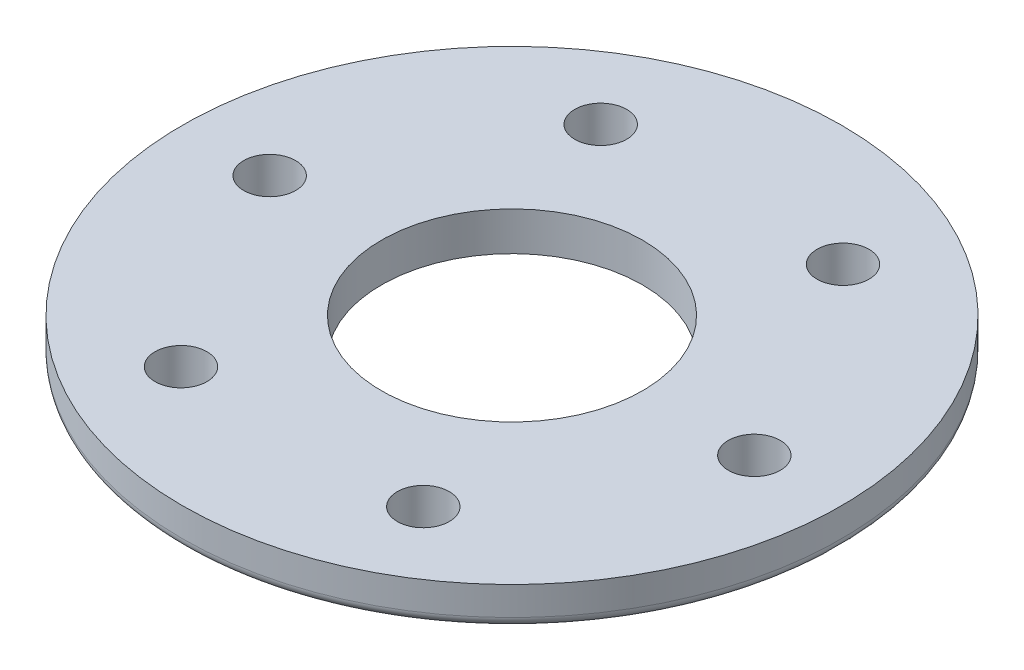
ISO-10303-21;
HEADER;
FILE_DESCRIPTION(('STEP AP214'),'2;1');
FILE_NAME('part.step','',(''),(''),'','','');
FILE_SCHEMA(('AUTOMOTIVE_DESIGN { 1 0 10303 214 1 1 1 1 }'));
ENDSEC;
DATA;
#1=APPLICATION_CONTEXT('core data for automotive mechanical design processes');
#2=APPLICATION_PROTOCOL_DEFINITION('international standard','automotive_design',2000,#1);
#3=PRODUCT_CONTEXT('',#1,'mechanical');
#4=PRODUCT('Part','Part','',(#3));
#5=PRODUCT_RELATED_PRODUCT_CATEGORY('part','',(#4));
#6=PRODUCT_DEFINITION_FORMATION('','',#4);
#7=PRODUCT_DEFINITION_CONTEXT('part definition',#1,'design');
#8=PRODUCT_DEFINITION('design','',#6,#7);
#9=PRODUCT_DEFINITION_SHAPE('','',#8);
#10=(LENGTH_UNIT() NAMED_UNIT(*) SI_UNIT(.MILLI.,.METRE.));
#11=(NAMED_UNIT(*) PLANE_ANGLE_UNIT() SI_UNIT($,.RADIAN.));
#12=(NAMED_UNIT(*) SI_UNIT($,.STERADIAN.) SOLID_ANGLE_UNIT());
#13=UNCERTAINTY_MEASURE_WITH_UNIT(LENGTH_MEASURE(1.E-05),#10,'distance_accuracy_value','');
#14=(GEOMETRIC_REPRESENTATION_CONTEXT(3) GLOBAL_UNCERTAINTY_ASSIGNED_CONTEXT((#13)) GLOBAL_UNIT_ASSIGNED_CONTEXT((#10,
#11,#12)) REPRESENTATION_CONTEXT('',''));
#15=CARTESIAN_POINT('',(0.,0.,0.));
#16=DIRECTION('',(0.,0.,1.));
#17=DIRECTION('',(1.,0.,0.));
#18=AXIS2_PLACEMENT_3D('',#15,#16,#17);
#19=CARTESIAN_POINT('',(0.,0.,0.));
#20=DIRECTION('',(0.,1.,0.));
#21=DIRECTION('',(0.,0.,1.));
#22=AXIS2_PLACEMENT_3D('',#19,#20,#21);
#23=CYLINDRICAL_SURFACE('',#22,32.385);
#24=CARTESIAN_POINT('',(0.,1.00000000000006,0.));
#25=DIRECTION('',(0.,-1.,0.));
#26=DIRECTION('',(0.,0.,-1.));
#27=AXIS2_PLACEMENT_3D('',#24,#25,#26);
#28=CIRCLE('',#27,32.385);
#29=CARTESIAN_POINT('',(0.,1.00000000000006,-32.385));
#30=VERTEX_POINT('',#29);
#31=EDGE_CURVE('E38',#30,#30,#28,.F.);
#32=ORIENTED_EDGE('',*,*,#31,.T.);
#33=EDGE_LOOP('',(#32));
#34=FACE_BOUND('',#33,.T.);
#35=CARTESIAN_POINT('',(0.,3.81,0.));
#36=DIRECTION('',(0.,1.,0.));
#37=DIRECTION('',(0.,0.,1.));
#38=AXIS2_PLACEMENT_3D('',#35,#36,#37);
#39=CIRCLE('',#38,32.385);
#40=CARTESIAN_POINT('',(0.,3.81,32.385));
#41=VERTEX_POINT('',#40);
#42=EDGE_CURVE('E42',#41,#41,#39,.T.);
#43=ORIENTED_EDGE('',*,*,#42,.F.);
#44=EDGE_LOOP('',(#43));
#45=FACE_BOUND('',#44,.T.);
#46=ADVANCED_FACE('F31',(#34,#45),#23,.T.);
#47=CARTESIAN_POINT('',(32.385,0.,0.));
#48=DIRECTION('',(0.,-1.,0.));
#49=DIRECTION('',(0.,0.,-1.));
#50=AXIS2_PLACEMENT_3D('',#47,#48,#49);
#51=PLANE('',#50);
#52=CARTESIAN_POINT('',(0.,0.,0.));
#53=DIRECTION('',(0.,-1.,0.));
#54=DIRECTION('',(0.,0.,-1.));
#55=AXIS2_PLACEMENT_3D('',#52,#53,#54);
#56=CIRCLE('',#55,31.3849999999999);
#57=CARTESIAN_POINT('',(0.,0.,-31.3849999999999));
#58=VERTEX_POINT('',#57);
#59=EDGE_CURVE('E10',#58,#58,#56,.T.);
#60=ORIENTED_EDGE('',*,*,#59,.T.);
#61=EDGE_LOOP('',(#60));
#62=FACE_BOUND('',#61,.T.);
#63=CARTESIAN_POINT('',(0.,0.,0.));
#64=DIRECTION('',(0.,-1.,0.));
#65=DIRECTION('',(0.,0.,-1.));
#66=AXIS2_PLACEMENT_3D('',#63,#64,#65);
#67=CIRCLE('',#66,12.827);
#68=CARTESIAN_POINT('',(0.,0.,-12.827));
#69=VERTEX_POINT('',#68);
#70=EDGE_CURVE('E87',#69,#69,#67,.T.);
#71=ORIENTED_EDGE('',*,*,#70,.F.);
#72=EDGE_LOOP('',(#71));
#73=FACE_BOUND('',#72,.T.);
#74=CARTESIAN_POINT('',(-11.90625,0.,-20.6222299276167));
#75=DIRECTION('',(0.,-1.,0.));
#76=DIRECTION('',(0.,0.,-1.));
#77=AXIS2_PLACEMENT_3D('',#74,#75,#76);
#78=CIRCLE('',#77,2.55269999999999);
#79=CARTESIAN_POINT('',(-11.90625,0.,-23.1749299276166));
#80=VERTEX_POINT('',#79);
#81=EDGE_CURVE('E81',#80,#80,#78,.T.);
#82=ORIENTED_EDGE('',*,*,#81,.F.);
#83=EDGE_LOOP('',(#82));
#84=FACE_BOUND('',#83,.T.);
#85=CARTESIAN_POINT('',(11.90625,0.,-20.6222299276167));
#86=DIRECTION('',(0.,-1.,0.));
#87=DIRECTION('',(0.,0.,-1.));
#88=AXIS2_PLACEMENT_3D('',#85,#86,#87);
#89=CIRCLE('',#88,2.55269999999999);
#90=CARTESIAN_POINT('',(11.90625,0.,-23.1749299276166));
#91=VERTEX_POINT('',#90);
#92=EDGE_CURVE('E75',#91,#91,#89,.T.);
#93=ORIENTED_EDGE('',*,*,#92,.F.);
#94=EDGE_LOOP('',(#93));
#95=FACE_BOUND('',#94,.T.);
#96=CARTESIAN_POINT('',(23.8125,0.,0.));
#97=DIRECTION('',(0.,-1.,0.));
#98=DIRECTION('',(0.,0.,-1.));
#99=AXIS2_PLACEMENT_3D('',#96,#97,#98);
#100=CIRCLE('',#99,2.55269999999999);
#101=CARTESIAN_POINT('',(23.8125,0.,-2.55269999999999));
#102=VERTEX_POINT('',#101);
#103=EDGE_CURVE('E69',#102,#102,#100,.T.);
#104=ORIENTED_EDGE('',*,*,#103,.F.);
#105=EDGE_LOOP('',(#104));
#106=FACE_BOUND('',#105,.T.);
#107=CARTESIAN_POINT('',(11.90625,0.,20.6222299276167));
#108=DIRECTION('',(0.,-1.,0.));
#109=DIRECTION('',(0.,0.,-1.));
#110=AXIS2_PLACEMENT_3D('',#107,#108,#109);
#111=CIRCLE('',#110,2.55269999999999);
#112=CARTESIAN_POINT('',(11.90625,0.,18.0695299276167));
#113=VERTEX_POINT('',#112);
#114=EDGE_CURVE('E63',#113,#113,#111,.T.);
#115=ORIENTED_EDGE('',*,*,#114,.F.);
#116=EDGE_LOOP('',(#115));
#117=FACE_BOUND('',#116,.T.);
#118=CARTESIAN_POINT('',(-11.90625,0.,20.6222299276167));
#119=DIRECTION('',(0.,-1.,0.));
#120=DIRECTION('',(0.,0.,-1.));
#121=AXIS2_PLACEMENT_3D('',#118,#119,#120);
#122=CIRCLE('',#121,2.55269999999999);
#123=CARTESIAN_POINT('',(-11.90625,0.,18.0695299276167));
#124=VERTEX_POINT('',#123);
#125=EDGE_CURVE('E57',#124,#124,#122,.T.);
#126=ORIENTED_EDGE('',*,*,#125,.F.);
#127=EDGE_LOOP('',(#126));
#128=FACE_BOUND('',#127,.T.);
#129=CARTESIAN_POINT('',(-23.8125,0.,0.));
#130=DIRECTION('',(0.,-1.,0.));
#131=DIRECTION('',(0.,0.,-1.));
#132=AXIS2_PLACEMENT_3D('',#129,#130,#131);
#133=CIRCLE('',#132,2.55269999999999);
#134=CARTESIAN_POINT('',(-23.8125,0.,-2.55269999999999));
#135=VERTEX_POINT('',#134);
#136=EDGE_CURVE('E51',#135,#135,#133,.T.);
#137=ORIENTED_EDGE('',*,*,#136,.F.);
#138=EDGE_LOOP('',(#137));
#139=FACE_BOUND('',#138,.T.);
#140=ADVANCED_FACE('F93',(#62,#73,#84,#95,#106,#117,#128,#139),#51,.T.);
#141=CARTESIAN_POINT('',(0.,3.81,0.));
#142=DIRECTION('',(0.,1.,0.));
#143=DIRECTION('',(0.,0.,1.));
#144=AXIS2_PLACEMENT_3D('',#141,#142,#143);
#145=PLANE('',#144);
#146=CARTESIAN_POINT('',(0.,3.80999999999999,0.));
#147=DIRECTION('',(0.,-1.,0.));
#148=DIRECTION('',(0.,0.,-1.));
#149=AXIS2_PLACEMENT_3D('',#146,#147,#148);
#150=CIRCLE('',#149,12.827);
#151=CARTESIAN_POINT('',(0.,3.80999999999999,-12.827));
#152=VERTEX_POINT('',#151);
#153=EDGE_CURVE('E84',#152,#152,#150,.T.);
#154=ORIENTED_EDGE('',*,*,#153,.T.);
#155=EDGE_LOOP('',(#154));
#156=FACE_BOUND('',#155,.T.);
#157=CARTESIAN_POINT('',(-11.90625,3.80999999999999,-20.6222299276167));
#158=DIRECTION('',(0.,-1.,0.));
#159=DIRECTION('',(0.,0.,-1.));
#160=AXIS2_PLACEMENT_3D('',#157,#158,#159);
#161=CIRCLE('',#160,2.55269999999999);
#162=CARTESIAN_POINT('',(-11.90625,3.80999999999999,-23.1749299276166));
#163=VERTEX_POINT('',#162);
#164=EDGE_CURVE('E78',#163,#163,#161,.T.);
#165=ORIENTED_EDGE('',*,*,#164,.T.);
#166=EDGE_LOOP('',(#165));
#167=FACE_BOUND('',#166,.T.);
#168=CARTESIAN_POINT('',(11.90625,3.80999999999999,-20.6222299276167));
#169=DIRECTION('',(0.,-1.,0.));
#170=DIRECTION('',(0.,0.,-1.));
#171=AXIS2_PLACEMENT_3D('',#168,#169,#170);
#172=CIRCLE('',#171,2.55269999999999);
#173=CARTESIAN_POINT('',(11.90625,3.80999999999999,-23.1749299276166));
#174=VERTEX_POINT('',#173);
#175=EDGE_CURVE('E72',#174,#174,#172,.T.);
#176=ORIENTED_EDGE('',*,*,#175,.T.);
#177=EDGE_LOOP('',(#176));
#178=FACE_BOUND('',#177,.T.);
#179=CARTESIAN_POINT('',(23.8125,3.80999999999999,0.));
#180=DIRECTION('',(0.,-1.,0.));
#181=DIRECTION('',(0.,0.,-1.));
#182=AXIS2_PLACEMENT_3D('',#179,#180,#181);
#183=CIRCLE('',#182,2.55269999999999);
#184=CARTESIAN_POINT('',(23.8125,3.80999999999999,-2.55269999999999));
#185=VERTEX_POINT('',#184);
#186=EDGE_CURVE('E66',#185,#185,#183,.T.);
#187=ORIENTED_EDGE('',*,*,#186,.T.);
#188=EDGE_LOOP('',(#187));
#189=FACE_BOUND('',#188,.T.);
#190=CARTESIAN_POINT('',(11.90625,3.80999999999999,20.6222299276167));
#191=DIRECTION('',(0.,-1.,0.));
#192=DIRECTION('',(0.,0.,-1.));
#193=AXIS2_PLACEMENT_3D('',#190,#191,#192);
#194=CIRCLE('',#193,2.55269999999999);
#195=CARTESIAN_POINT('',(11.90625,3.80999999999999,18.0695299276167));
#196=VERTEX_POINT('',#195);
#197=EDGE_CURVE('E60',#196,#196,#194,.T.);
#198=ORIENTED_EDGE('',*,*,#197,.T.);
#199=EDGE_LOOP('',(#198));
#200=FACE_BOUND('',#199,.T.);
#201=CARTESIAN_POINT('',(-11.90625,3.80999999999999,20.6222299276167));
#202=DIRECTION('',(0.,-1.,0.));
#203=DIRECTION('',(0.,0.,-1.));
#204=AXIS2_PLACEMENT_3D('',#201,#202,#203);
#205=CIRCLE('',#204,2.55269999999999);
#206=CARTESIAN_POINT('',(-11.90625,3.80999999999999,18.0695299276167));
#207=VERTEX_POINT('',#206);
#208=EDGE_CURVE('E54',#207,#207,#205,.T.);
#209=ORIENTED_EDGE('',*,*,#208,.T.);
#210=EDGE_LOOP('',(#209));
#211=FACE_BOUND('',#210,.T.);
#212=CARTESIAN_POINT('',(-23.8125,3.80999999999999,0.));
#213=DIRECTION('',(0.,-1.,0.));
#214=DIRECTION('',(0.,0.,-1.));
#215=AXIS2_PLACEMENT_3D('',#212,#213,#214);
#216=CIRCLE('',#215,2.55269999999999);
#217=CARTESIAN_POINT('',(-23.8125,3.80999999999999,-2.55269999999999));
#218=VERTEX_POINT('',#217);
#219=EDGE_CURVE('E46',#218,#218,#216,.T.);
#220=ORIENTED_EDGE('',*,*,#219,.T.);
#221=EDGE_LOOP('',(#220));
#222=FACE_BOUND('',#221,.T.);
#223=ORIENTED_EDGE('',*,*,#42,.T.);
#224=EDGE_LOOP('',(#223));
#225=FACE_BOUND('',#224,.T.);
#226=ADVANCED_FACE('F96',(#156,#167,#178,#189,#200,#211,#222,#225),#145,.T.);
#227=CARTESIAN_POINT('',(-23.8125,0.,0.));
#228=DIRECTION('',(0.,-1.,0.));
#229=DIRECTION('',(0.,0.,-1.));
#230=AXIS2_PLACEMENT_3D('',#227,#228,#229);
#231=CYLINDRICAL_SURFACE('',#230,2.55269999999999);
#232=ORIENTED_EDGE('',*,*,#219,.F.);
#233=EDGE_LOOP('',(#232));
#234=FACE_BOUND('',#233,.T.);
#235=ORIENTED_EDGE('',*,*,#136,.T.);
#236=EDGE_LOOP('',(#235));
#237=FACE_BOUND('',#236,.T.);
#238=ADVANCED_FACE('F110',(#234,#237),#231,.F.);
#239=CARTESIAN_POINT('',(-11.90625,0.,20.6222299276167));
#240=DIRECTION('',(0.,-1.,0.));
#241=DIRECTION('',(0.,0.,-1.));
#242=AXIS2_PLACEMENT_3D('',#239,#240,#241);
#243=CYLINDRICAL_SURFACE('',#242,2.55269999999999);
#244=ORIENTED_EDGE('',*,*,#208,.F.);
#245=EDGE_LOOP('',(#244));
#246=FACE_BOUND('',#245,.T.);
#247=ORIENTED_EDGE('',*,*,#125,.T.);
#248=EDGE_LOOP('',(#247));
#249=FACE_BOUND('',#248,.T.);
#250=ADVANCED_FACE('F112',(#246,#249),#243,.F.);
#251=CARTESIAN_POINT('',(11.90625,0.,20.6222299276167));
#252=DIRECTION('',(0.,-1.,0.));
#253=DIRECTION('',(0.,0.,-1.));
#254=AXIS2_PLACEMENT_3D('',#251,#252,#253);
#255=CYLINDRICAL_SURFACE('',#254,2.55269999999999);
#256=ORIENTED_EDGE('',*,*,#197,.F.);
#257=EDGE_LOOP('',(#256));
#258=FACE_BOUND('',#257,.T.);
#259=ORIENTED_EDGE('',*,*,#114,.T.);
#260=EDGE_LOOP('',(#259));
#261=FACE_BOUND('',#260,.T.);
#262=ADVANCED_FACE('F119',(#258,#261),#255,.F.);
#263=CARTESIAN_POINT('',(23.8125,0.,0.));
#264=DIRECTION('',(0.,-1.,0.));
#265=DIRECTION('',(0.,0.,-1.));
#266=AXIS2_PLACEMENT_3D('',#263,#264,#265);
#267=CYLINDRICAL_SURFACE('',#266,2.55269999999999);
#268=ORIENTED_EDGE('',*,*,#186,.F.);
#269=EDGE_LOOP('',(#268));
#270=FACE_BOUND('',#269,.T.);
#271=ORIENTED_EDGE('',*,*,#103,.T.);
#272=EDGE_LOOP('',(#271));
#273=FACE_BOUND('',#272,.T.);
#274=ADVANCED_FACE('F175',(#270,#273),#267,.F.);
#275=CARTESIAN_POINT('',(11.90625,0.,-20.6222299276167));
#276=DIRECTION('',(0.,-1.,0.));
#277=DIRECTION('',(0.,0.,-1.));
#278=AXIS2_PLACEMENT_3D('',#275,#276,#277);
#279=CYLINDRICAL_SURFACE('',#278,2.55269999999999);
#280=ORIENTED_EDGE('',*,*,#175,.F.);
#281=EDGE_LOOP('',(#280));
#282=FACE_BOUND('',#281,.T.);
#283=ORIENTED_EDGE('',*,*,#92,.T.);
#284=EDGE_LOOP('',(#283));
#285=FACE_BOUND('',#284,.T.);
#286=ADVANCED_FACE('F170',(#282,#285),#279,.F.);
#287=CARTESIAN_POINT('',(-11.90625,0.,-20.6222299276167));
#288=DIRECTION('',(0.,-1.,0.));
#289=DIRECTION('',(0.,0.,-1.));
#290=AXIS2_PLACEMENT_3D('',#287,#288,#289);
#291=CYLINDRICAL_SURFACE('',#290,2.55269999999999);
#292=ORIENTED_EDGE('',*,*,#164,.F.);
#293=EDGE_LOOP('',(#292));
#294=FACE_BOUND('',#293,.T.);
#295=ORIENTED_EDGE('',*,*,#81,.T.);
#296=EDGE_LOOP('',(#295));
#297=FACE_BOUND('',#296,.T.);
#298=ADVANCED_FACE('F147',(#294,#297),#291,.F.);
#299=CARTESIAN_POINT('',(0.,0.,0.));
#300=DIRECTION('',(0.,-1.,0.));
#301=DIRECTION('',(0.,0.,-1.));
#302=AXIS2_PLACEMENT_3D('',#299,#300,#301);
#303=CYLINDRICAL_SURFACE('',#302,12.827);
#304=ORIENTED_EDGE('',*,*,#153,.F.);
#305=EDGE_LOOP('',(#304));
#306=FACE_BOUND('',#305,.T.);
#307=ORIENTED_EDGE('',*,*,#70,.T.);
#308=EDGE_LOOP('',(#307));
#309=FACE_BOUND('',#308,.T.);
#310=ADVANCED_FACE('F91',(#306,#309),#303,.F.);
#311=CARTESIAN_POINT('',(0.,1.00000000000006,0.));
#312=DIRECTION('',(0.,-1.,0.));
#313=DIRECTION('',(0.,0.,-1.));
#314=AXIS2_PLACEMENT_3D('',#311,#312,#313);
#315=TOROIDAL_SURFACE('',#314,31.3849999999999,1.00000000000006);
#316=ORIENTED_EDGE('',*,*,#59,.F.);
#317=EDGE_LOOP('',(#316));
#318=FACE_BOUND('',#317,.T.);
#319=ORIENTED_EDGE('',*,*,#31,.F.);
#320=EDGE_LOOP('',(#319));
#321=FACE_BOUND('',#320,.T.);
#322=ADVANCED_FACE('F33',(#318,#321),#315,.T.);
#323=CLOSED_SHELL('',(#46,#140,#226,#238,#250,#262,#274,#286,#298,#310,#322));
#324=MANIFOLD_SOLID_BREP('B2',#323);
#325=ADVANCED_BREP_SHAPE_REPRESENTATION('',(#18,#324),#14);
#326=SHAPE_DEFINITION_REPRESENTATION(#9,#325);
ENDSEC;
END-ISO-10303-21;
